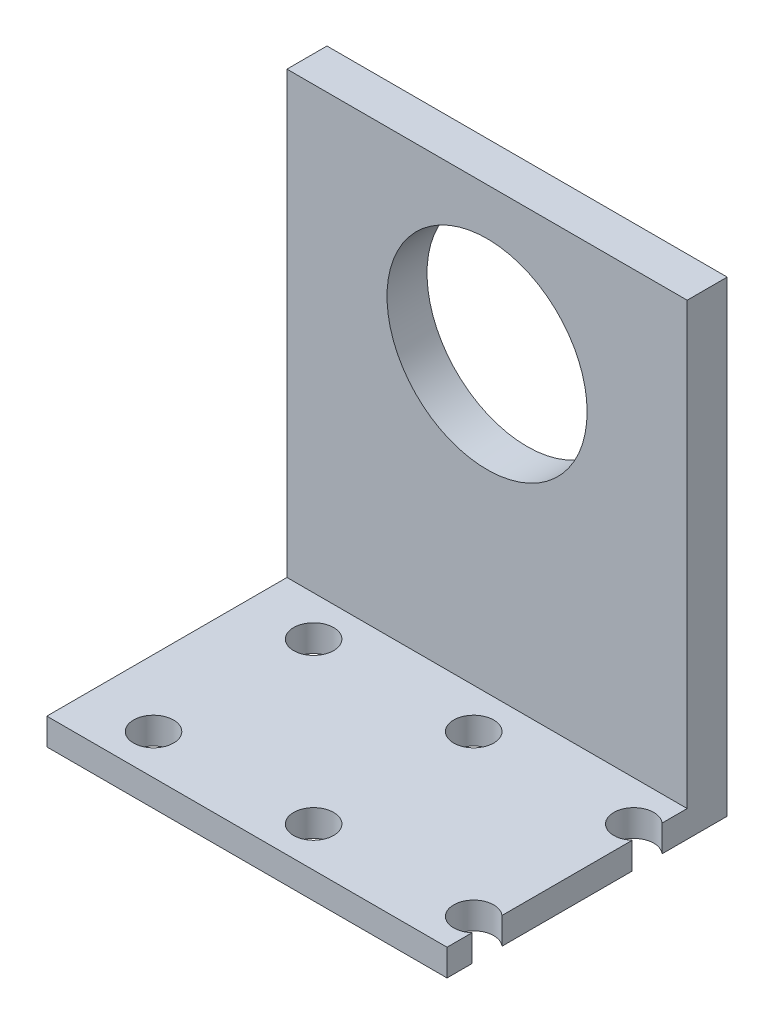
ISO-10303-21;
HEADER;
FILE_DESCRIPTION(('STEP AP214'),'2;1');
FILE_NAME('part.step','',(''),(''),'','','');
FILE_SCHEMA(('AUTOMOTIVE_DESIGN { 1 0 10303 214 1 1 1 1 }'));
ENDSEC;
DATA;
#1=APPLICATION_CONTEXT('core data for automotive mechanical design processes');
#2=APPLICATION_PROTOCOL_DEFINITION('international standard','automotive_design',2000,#1);
#3=PRODUCT_CONTEXT('',#1,'mechanical');
#4=PRODUCT('Part','Part','',(#3));
#5=PRODUCT_RELATED_PRODUCT_CATEGORY('part','',(#4));
#6=PRODUCT_DEFINITION_FORMATION('','',#4);
#7=PRODUCT_DEFINITION_CONTEXT('part definition',#1,'design');
#8=PRODUCT_DEFINITION('design','',#6,#7);
#9=PRODUCT_DEFINITION_SHAPE('','',#8);
#10=(LENGTH_UNIT() NAMED_UNIT(*) SI_UNIT(.MILLI.,.METRE.));
#11=(NAMED_UNIT(*) PLANE_ANGLE_UNIT() SI_UNIT($,.RADIAN.));
#12=(NAMED_UNIT(*) SI_UNIT($,.STERADIAN.) SOLID_ANGLE_UNIT());
#13=UNCERTAINTY_MEASURE_WITH_UNIT(LENGTH_MEASURE(1.E-05),#10,'distance_accuracy_value','');
#14=(GEOMETRIC_REPRESENTATION_CONTEXT(3) GLOBAL_UNCERTAINTY_ASSIGNED_CONTEXT((#13)) GLOBAL_UNIT_ASSIGNED_CONTEXT((#10,
#11,#12)) REPRESENTATION_CONTEXT('',''));
#15=CARTESIAN_POINT('',(0.,0.,0.));
#16=DIRECTION('',(0.,0.,1.));
#17=DIRECTION('',(1.,0.,0.));
#18=AXIS2_PLACEMENT_3D('',#15,#16,#17);
#19=CARTESIAN_POINT('',(30.,0.,0.));
#20=DIRECTION('',(-1.,0.,0.));
#21=DIRECTION('',(0.,0.,1.));
#22=AXIS2_PLACEMENT_3D('',#19,#20,#21);
#23=PLANE('',#22);
#24=DIRECTION('',(0.,0.,-1.));
#25=VECTOR('',#24,1.);
#26=CARTESIAN_POINT('',(30.,-2.,-21.));
#27=LINE('',#26,#25);
#28=CARTESIAN_POINT('',(30.,-2.,-4.1180339887499));
#29=VERTEX_POINT('',#28);
#30=CARTESIAN_POINT('',(30.,-2.,-13.8819660112501));
#31=VERTEX_POINT('',#30);
#32=EDGE_CURVE('E175',#29,#31,#27,.T.);
#33=ORIENTED_EDGE('',*,*,#32,.T.);
#34=DIRECTION('',(0.,1.,0.));
#35=VECTOR('',#34,1.);
#36=CARTESIAN_POINT('',(30.,-30.,-13.8819660112501));
#37=LINE('',#36,#35);
#38=CARTESIAN_POINT('',(30.,0.,-13.8819660112501));
#39=VERTEX_POINT('',#38);
#40=EDGE_CURVE('E11',#31,#39,#37,.T.);
#41=ORIENTED_EDGE('',*,*,#40,.T.);
#42=DIRECTION('',(0.,0.,1.));
#43=VECTOR('',#42,1.);
#44=CARTESIAN_POINT('',(30.,0.,0.));
#45=LINE('',#44,#43);
#46=CARTESIAN_POINT('',(30.,0.,-4.1180339887499));
#47=VERTEX_POINT('',#46);
#48=EDGE_CURVE('E132',#39,#47,#45,.T.);
#49=ORIENTED_EDGE('',*,*,#48,.T.);
#50=DIRECTION('',(0.,1.,0.));
#51=VECTOR('',#50,1.);
#52=CARTESIAN_POINT('',(30.,-30.,-4.1180339887499));
#53=LINE('',#52,#51);
#54=EDGE_CURVE('E112',#47,#29,#53,.F.);
#55=ORIENTED_EDGE('',*,*,#54,.T.);
#56=EDGE_LOOP('',(#33,#41,#49,#55));
#57=FACE_BOUND('',#56,.T.);
#58=ADVANCED_FACE('F33',(#57),#23,.F.);
#59=CARTESIAN_POINT('',(30.,-2.,0.));
#60=VERTEX_POINT('',#59);
#61=CARTESIAN_POINT('',(30.,-2.,-1.8819660112501));
#62=VERTEX_POINT('',#61);
#63=EDGE_CURVE('E126',#60,#62,#27,.T.);
#64=ORIENTED_EDGE('',*,*,#63,.T.);
#65=DIRECTION('',(0.,1.,0.));
#66=VECTOR('',#65,1.);
#67=CARTESIAN_POINT('',(30.,-30.,-1.8819660112501));
#68=LINE('',#67,#66);
#69=CARTESIAN_POINT('',(30.,0.,-1.8819660112501));
#70=VERTEX_POINT('',#69);
#71=EDGE_CURVE('E111',#62,#70,#68,.T.);
#72=ORIENTED_EDGE('',*,*,#71,.T.);
#73=CARTESIAN_POINT('',(30.,0.,0.));
#74=VERTEX_POINT('',#73);
#75=EDGE_CURVE('E124',#70,#74,#45,.T.);
#76=ORIENTED_EDGE('',*,*,#75,.T.);
#77=DIRECTION('',(0.,-1.,0.));
#78=VECTOR('',#77,1.);
#79=CARTESIAN_POINT('',(30.,-2.,0.));
#80=LINE('',#79,#78);
#81=EDGE_CURVE('E176',#74,#60,#80,.T.);
#82=ORIENTED_EDGE('',*,*,#81,.T.);
#83=EDGE_LOOP('',(#64,#72,#76,#82));
#84=FACE_BOUND('',#83,.T.);
#85=ADVANCED_FACE('F122',(#84),#23,.F.);
#86=CARTESIAN_POINT('',(30.,-2.,0.));
#87=DIRECTION('',(0.,0.,-1.));
#88=DIRECTION('',(-1.,0.,0.));
#89=AXIS2_PLACEMENT_3D('',#86,#87,#88);
#90=PLANE('',#89);
#91=DIRECTION('',(0.,-1.,0.));
#92=VECTOR('',#91,1.);
#93=CARTESIAN_POINT('',(0.,-2.,0.));
#94=LINE('',#93,#92);
#95=CARTESIAN_POINT('',(0.,0.,0.));
#96=VERTEX_POINT('',#95);
#97=CARTESIAN_POINT('',(0.,-2.,0.));
#98=VERTEX_POINT('',#97);
#99=EDGE_CURVE('E226',#96,#98,#94,.T.);
#100=ORIENTED_EDGE('',*,*,#99,.T.);
#101=DIRECTION('',(-1.,0.,0.));
#102=VECTOR('',#101,1.);
#103=CARTESIAN_POINT('',(30.,-2.,0.));
#104=LINE('',#103,#102);
#105=EDGE_CURVE('E162',#60,#98,#104,.T.);
#106=ORIENTED_EDGE('',*,*,#105,.F.);
#107=ORIENTED_EDGE('',*,*,#81,.F.);
#108=DIRECTION('',(-1.,0.,0.));
#109=VECTOR('',#108,1.);
#110=CARTESIAN_POINT('',(30.,0.,0.));
#111=LINE('',#110,#109);
#112=EDGE_CURVE('E130',#74,#96,#111,.T.);
#113=ORIENTED_EDGE('',*,*,#112,.T.);
#114=EDGE_LOOP('',(#100,#106,#107,#113));
#115=FACE_BOUND('',#114,.T.);
#116=ADVANCED_FACE('F35',(#115),#90,.F.);
#117=CARTESIAN_POINT('',(30.,-2.,-21.));
#118=DIRECTION('',(0.,1.,0.));
#119=DIRECTION('',(0.,0.,1.));
#120=AXIS2_PLACEMENT_3D('',#117,#118,#119);
#121=PLANE('',#120);
#122=CARTESIAN_POINT('',(5.,-2.,-15.));
#123=DIRECTION('',(0.,1.,0.));
#124=DIRECTION('',(0.,0.,1.));
#125=AXIS2_PLACEMENT_3D('',#122,#123,#124);
#126=CIRCLE('',#125,1.5);
#127=CARTESIAN_POINT('',(5.,-2.,-13.5));
#128=VERTEX_POINT('',#127);
#129=EDGE_CURVE('E218',#128,#128,#126,.T.);
#130=ORIENTED_EDGE('',*,*,#129,.T.);
#131=EDGE_LOOP('',(#130));
#132=FACE_BOUND('',#131,.T.);
#133=CARTESIAN_POINT('',(17.,-2.,-15.));
#134=DIRECTION('',(0.,1.,0.));
#135=DIRECTION('',(0.,0.,1.));
#136=AXIS2_PLACEMENT_3D('',#133,#134,#135);
#137=CIRCLE('',#136,1.5);
#138=CARTESIAN_POINT('',(17.,-2.,-13.5));
#139=VERTEX_POINT('',#138);
#140=EDGE_CURVE('E215',#139,#139,#137,.T.);
#141=ORIENTED_EDGE('',*,*,#140,.T.);
#142=EDGE_LOOP('',(#141));
#143=FACE_BOUND('',#142,.T.);
#144=CARTESIAN_POINT('',(17.,-2.,-3.));
#145=DIRECTION('',(0.,1.,0.));
#146=DIRECTION('',(0.,0.,1.));
#147=AXIS2_PLACEMENT_3D('',#144,#145,#146);
#148=CIRCLE('',#147,1.5);
#149=CARTESIAN_POINT('',(17.,-2.,-1.5));
#150=VERTEX_POINT('',#149);
#151=EDGE_CURVE('E212',#150,#150,#148,.T.);
#152=ORIENTED_EDGE('',*,*,#151,.T.);
#153=EDGE_LOOP('',(#152));
#154=FACE_BOUND('',#153,.T.);
#155=CARTESIAN_POINT('',(5.,-2.,-3.));
#156=DIRECTION('',(0.,1.,0.));
#157=DIRECTION('',(0.,0.,1.));
#158=AXIS2_PLACEMENT_3D('',#155,#156,#157);
#159=CIRCLE('',#158,1.5);
#160=CARTESIAN_POINT('',(5.,-2.,-1.5));
#161=VERTEX_POINT('',#160);
#162=EDGE_CURVE('E209',#161,#161,#159,.T.);
#163=ORIENTED_EDGE('',*,*,#162,.T.);
#164=EDGE_LOOP('',(#163));
#165=FACE_BOUND('',#164,.T.);
#166=CARTESIAN_POINT('',(30.,-2.,-16.1180339887499));
#167=VERTEX_POINT('',#166);
#168=CARTESIAN_POINT('',(30.,-2.,-21.));
#169=VERTEX_POINT('',#168);
#170=EDGE_CURVE('E167',#167,#169,#27,.T.);
#171=ORIENTED_EDGE('',*,*,#170,.F.);
#172=CARTESIAN_POINT('',(29.,-2.,-15.));
#173=DIRECTION('',(0.,1.,0.));
#174=DIRECTION('',(0.,0.,1.));
#175=AXIS2_PLACEMENT_3D('',#172,#173,#174);
#176=CIRCLE('',#175,1.5);
#177=EDGE_CURVE('E48',#167,#31,#176,.T.);
#178=ORIENTED_EDGE('',*,*,#177,.T.);
#179=ORIENTED_EDGE('',*,*,#32,.F.);
#180=CARTESIAN_POINT('',(29.,-2.,-3.));
#181=DIRECTION('',(0.,1.,0.));
#182=DIRECTION('',(0.,0.,1.));
#183=AXIS2_PLACEMENT_3D('',#180,#181,#182);
#184=CIRCLE('',#183,1.5);
#185=EDGE_CURVE('E56',#29,#62,#184,.T.);
#186=ORIENTED_EDGE('',*,*,#185,.T.);
#187=ORIENTED_EDGE('',*,*,#63,.F.);
#188=ORIENTED_EDGE('',*,*,#105,.T.);
#189=DIRECTION('',(0.,0.,-1.));
#190=VECTOR('',#189,1.);
#191=CARTESIAN_POINT('',(0.,-2.,-21.));
#192=LINE('',#191,#190);
#193=CARTESIAN_POINT('',(0.,-2.,-21.));
#194=VERTEX_POINT('',#193);
#195=EDGE_CURVE('E229',#98,#194,#192,.T.);
#196=ORIENTED_EDGE('',*,*,#195,.T.);
#197=DIRECTION('',(-1.,0.,0.));
#198=VECTOR('',#197,1.);
#199=CARTESIAN_POINT('',(30.,-2.,-21.));
#200=LINE('',#199,#198);
#201=EDGE_CURVE('E159',#169,#194,#200,.T.);
#202=ORIENTED_EDGE('',*,*,#201,.F.);
#203=EDGE_LOOP('',(#171,#178,#179,#186,#187,#188,#196,#202));
#204=FACE_BOUND('',#203,.T.);
#205=ADVANCED_FACE('F171',(#132,#143,#154,#165,#204),#121,.F.);
#206=CARTESIAN_POINT('',(30.,33.,-21.));
#207=DIRECTION('',(0.,0.,1.));
#208=DIRECTION('',(0.,-1.,0.));
#209=AXIS2_PLACEMENT_3D('',#206,#207,#208);
#210=PLANE('',#209);
#211=CARTESIAN_POINT('',(15.,22.,-21.));
#212=DIRECTION('',(0.,0.,1.));
#213=DIRECTION('',(0.,-1.,0.));
#214=AXIS2_PLACEMENT_3D('',#211,#212,#213);
#215=CIRCLE('',#214,7.5);
#216=CARTESIAN_POINT('',(15.,14.5,-21.));
#217=VERTEX_POINT('',#216);
#218=EDGE_CURVE('E224',#217,#217,#215,.T.);
#219=ORIENTED_EDGE('',*,*,#218,.T.);
#220=EDGE_LOOP('',(#219));
#221=FACE_BOUND('',#220,.T.);
#222=DIRECTION('',(0.,1.,0.));
#223=VECTOR('',#222,1.);
#224=CARTESIAN_POINT('',(0.,33.,-21.));
#225=LINE('',#224,#223);
#226=CARTESIAN_POINT('',(0.,33.,-21.));
#227=VERTEX_POINT('',#226);
#228=EDGE_CURVE('E231',#194,#227,#225,.T.);
#229=ORIENTED_EDGE('',*,*,#228,.T.);
#230=DIRECTION('',(-1.,0.,0.));
#231=VECTOR('',#230,1.);
#232=CARTESIAN_POINT('',(30.,33.,-21.));
#233=LINE('',#232,#231);
#234=CARTESIAN_POINT('',(30.,33.,-21.));
#235=VERTEX_POINT('',#234);
#236=EDGE_CURVE('E156',#235,#227,#233,.T.);
#237=ORIENTED_EDGE('',*,*,#236,.F.);
#238=DIRECTION('',(0.,1.,0.));
#239=VECTOR('',#238,1.);
#240=CARTESIAN_POINT('',(30.,33.,-21.));
#241=LINE('',#240,#239);
#242=EDGE_CURVE('E180',#169,#235,#241,.T.);
#243=ORIENTED_EDGE('',*,*,#242,.F.);
#244=ORIENTED_EDGE('',*,*,#201,.T.);
#245=EDGE_LOOP('',(#229,#237,#243,#244));
#246=FACE_BOUND('',#245,.T.);
#247=ADVANCED_FACE('F243',(#221,#246),#210,.F.);
#248=CARTESIAN_POINT('',(30.,33.,-18.));
#249=DIRECTION('',(0.,-1.,0.));
#250=DIRECTION('',(0.,0.,-1.));
#251=AXIS2_PLACEMENT_3D('',#248,#249,#250);
#252=PLANE('',#251);
#253=DIRECTION('',(0.,0.,1.));
#254=VECTOR('',#253,1.);
#255=CARTESIAN_POINT('',(0.,33.,-18.));
#256=LINE('',#255,#254);
#257=CARTESIAN_POINT('',(0.,33.,-18.));
#258=VERTEX_POINT('',#257);
#259=EDGE_CURVE('E190',#227,#258,#256,.T.);
#260=ORIENTED_EDGE('',*,*,#259,.T.);
#261=DIRECTION('',(-1.,0.,0.));
#262=VECTOR('',#261,1.);
#263=CARTESIAN_POINT('',(30.,33.,-18.));
#264=LINE('',#263,#262);
#265=CARTESIAN_POINT('',(30.,33.,-18.));
#266=VERTEX_POINT('',#265);
#267=EDGE_CURVE('E148',#266,#258,#264,.T.);
#268=ORIENTED_EDGE('',*,*,#267,.F.);
#269=DIRECTION('',(0.,0.,1.));
#270=VECTOR('',#269,1.);
#271=CARTESIAN_POINT('',(30.,33.,-18.));
#272=LINE('',#271,#270);
#273=EDGE_CURVE('E136',#235,#266,#272,.T.);
#274=ORIENTED_EDGE('',*,*,#273,.F.);
#275=ORIENTED_EDGE('',*,*,#236,.T.);
#276=EDGE_LOOP('',(#260,#268,#274,#275));
#277=FACE_BOUND('',#276,.T.);
#278=ADVANCED_FACE('F188',(#277),#252,.F.);
#279=CARTESIAN_POINT('',(30.,0.,-18.));
#280=DIRECTION('',(0.,0.,-1.));
#281=DIRECTION('',(-1.,0.,0.));
#282=AXIS2_PLACEMENT_3D('',#279,#280,#281);
#283=PLANE('',#282);
#284=CARTESIAN_POINT('',(15.,22.,-18.));
#285=DIRECTION('',(0.,0.,1.));
#286=DIRECTION('',(1.,0.,0.));
#287=AXIS2_PLACEMENT_3D('',#284,#285,#286);
#288=CIRCLE('',#287,7.5);
#289=CARTESIAN_POINT('',(22.5,22.,-18.));
#290=VERTEX_POINT('',#289);
#291=EDGE_CURVE('E221',#290,#290,#288,.T.);
#292=ORIENTED_EDGE('',*,*,#291,.F.);
#293=EDGE_LOOP('',(#292));
#294=FACE_BOUND('',#293,.T.);
#295=DIRECTION('',(0.,-1.,0.));
#296=VECTOR('',#295,1.);
#297=CARTESIAN_POINT('',(0.,0.,-18.));
#298=LINE('',#297,#296);
#299=CARTESIAN_POINT('',(0.,0.,-18.));
#300=VERTEX_POINT('',#299);
#301=EDGE_CURVE('E194',#258,#300,#298,.T.);
#302=ORIENTED_EDGE('',*,*,#301,.T.);
#303=DIRECTION('',(-1.,0.,0.));
#304=VECTOR('',#303,1.);
#305=CARTESIAN_POINT('',(30.,0.,-18.));
#306=LINE('',#305,#304);
#307=CARTESIAN_POINT('',(30.,0.,-18.));
#308=VERTEX_POINT('',#307);
#309=EDGE_CURVE('E142',#308,#300,#306,.T.);
#310=ORIENTED_EDGE('',*,*,#309,.F.);
#311=DIRECTION('',(0.,-1.,0.));
#312=VECTOR('',#311,1.);
#313=CARTESIAN_POINT('',(30.,0.,-18.));
#314=LINE('',#313,#312);
#315=EDGE_CURVE('E133',#266,#308,#314,.T.);
#316=ORIENTED_EDGE('',*,*,#315,.F.);
#317=ORIENTED_EDGE('',*,*,#267,.T.);
#318=EDGE_LOOP('',(#302,#310,#316,#317));
#319=FACE_BOUND('',#318,.T.);
#320=ADVANCED_FACE('F193',(#294,#319),#283,.F.);
#321=CARTESIAN_POINT('',(30.,0.,0.));
#322=DIRECTION('',(0.,-1.,0.));
#323=DIRECTION('',(0.,0.,-1.));
#324=AXIS2_PLACEMENT_3D('',#321,#322,#323);
#325=PLANE('',#324);
#326=CARTESIAN_POINT('',(5.,0.,-15.));
#327=DIRECTION('',(0.,1.,0.));
#328=DIRECTION('',(0.,0.,1.));
#329=AXIS2_PLACEMENT_3D('',#326,#327,#328);
#330=CIRCLE('',#329,1.5);
#331=CARTESIAN_POINT('',(5.,0.,-13.5));
#332=VERTEX_POINT('',#331);
#333=EDGE_CURVE('E197',#332,#332,#330,.T.);
#334=ORIENTED_EDGE('',*,*,#333,.F.);
#335=EDGE_LOOP('',(#334));
#336=FACE_BOUND('',#335,.T.);
#337=CARTESIAN_POINT('',(17.,0.,-15.));
#338=DIRECTION('',(0.,1.,0.));
#339=DIRECTION('',(0.,0.,1.));
#340=AXIS2_PLACEMENT_3D('',#337,#338,#339);
#341=CIRCLE('',#340,1.5);
#342=CARTESIAN_POINT('',(17.,0.,-13.5));
#343=VERTEX_POINT('',#342);
#344=EDGE_CURVE('E118',#343,#343,#341,.T.);
#345=ORIENTED_EDGE('',*,*,#344,.F.);
#346=EDGE_LOOP('',(#345));
#347=FACE_BOUND('',#346,.T.);
#348=CARTESIAN_POINT('',(17.,0.,-3.));
#349=DIRECTION('',(0.,1.,0.));
#350=DIRECTION('',(0.,0.,1.));
#351=AXIS2_PLACEMENT_3D('',#348,#349,#350);
#352=CIRCLE('',#351,1.5);
#353=CARTESIAN_POINT('',(17.,0.,-1.5));
#354=VERTEX_POINT('',#353);
#355=EDGE_CURVE('E117',#354,#354,#352,.T.);
#356=ORIENTED_EDGE('',*,*,#355,.F.);
#357=EDGE_LOOP('',(#356));
#358=FACE_BOUND('',#357,.T.);
#359=CARTESIAN_POINT('',(5.,0.,-3.));
#360=DIRECTION('',(0.,1.,0.));
#361=DIRECTION('',(0.,0.,1.));
#362=AXIS2_PLACEMENT_3D('',#359,#360,#361);
#363=CIRCLE('',#362,1.5);
#364=CARTESIAN_POINT('',(5.,0.,-1.5));
#365=VERTEX_POINT('',#364);
#366=EDGE_CURVE('E204',#365,#365,#363,.T.);
#367=ORIENTED_EDGE('',*,*,#366,.F.);
#368=EDGE_LOOP('',(#367));
#369=FACE_BOUND('',#368,.T.);
#370=ORIENTED_EDGE('',*,*,#48,.F.);
#371=CARTESIAN_POINT('',(29.,0.,-15.));
#372=DIRECTION('',(0.,1.,0.));
#373=DIRECTION('',(0.,0.,1.));
#374=AXIS2_PLACEMENT_3D('',#371,#372,#373);
#375=CIRCLE('',#374,1.5);
#376=CARTESIAN_POINT('',(30.,0.,-16.1180339887499));
#377=VERTEX_POINT('',#376);
#378=EDGE_CURVE('E196',#377,#39,#375,.T.);
#379=ORIENTED_EDGE('',*,*,#378,.F.);
#380=EDGE_CURVE('E135',#308,#377,#45,.T.);
#381=ORIENTED_EDGE('',*,*,#380,.F.);
#382=ORIENTED_EDGE('',*,*,#309,.T.);
#383=DIRECTION('',(0.,0.,1.));
#384=VECTOR('',#383,1.);
#385=CARTESIAN_POINT('',(0.,0.,0.));
#386=LINE('',#385,#384);
#387=EDGE_CURVE('E151',#300,#96,#386,.T.);
#388=ORIENTED_EDGE('',*,*,#387,.T.);
#389=ORIENTED_EDGE('',*,*,#112,.F.);
#390=ORIENTED_EDGE('',*,*,#75,.F.);
#391=CARTESIAN_POINT('',(29.,0.,-3.));
#392=DIRECTION('',(0.,1.,0.));
#393=DIRECTION('',(0.,0.,1.));
#394=AXIS2_PLACEMENT_3D('',#391,#392,#393);
#395=CIRCLE('',#394,1.5);
#396=EDGE_CURVE('E108',#47,#70,#395,.T.);
#397=ORIENTED_EDGE('',*,*,#396,.F.);
#398=EDGE_LOOP('',(#370,#379,#381,#382,#388,#389,#390,#397));
#399=FACE_BOUND('',#398,.T.);
#400=ADVANCED_FACE('F128',(#336,#347,#358,#369,#399),#325,.F.);
#401=ORIENTED_EDGE('',*,*,#380,.T.);
#402=DIRECTION('',(0.,1.,0.));
#403=VECTOR('',#402,1.);
#404=CARTESIAN_POINT('',(30.,-30.,-16.1180339887499));
#405=LINE('',#404,#403);
#406=EDGE_CURVE('E41',#377,#167,#405,.F.);
#407=ORIENTED_EDGE('',*,*,#406,.T.);
#408=ORIENTED_EDGE('',*,*,#170,.T.);
#409=ORIENTED_EDGE('',*,*,#242,.T.);
#410=ORIENTED_EDGE('',*,*,#273,.T.);
#411=ORIENTED_EDGE('',*,*,#315,.T.);
#412=EDGE_LOOP('',(#401,#407,#408,#409,#410,#411));
#413=FACE_BOUND('',#412,.T.);
#414=ADVANCED_FACE('F166',(#413),#23,.F.);
#415=CARTESIAN_POINT('',(0.,0.,0.));
#416=DIRECTION('',(-1.,0.,0.));
#417=DIRECTION('',(0.,0.,1.));
#418=AXIS2_PLACEMENT_3D('',#415,#416,#417);
#419=PLANE('',#418);
#420=ORIENTED_EDGE('',*,*,#99,.F.);
#421=ORIENTED_EDGE('',*,*,#387,.F.);
#422=ORIENTED_EDGE('',*,*,#301,.F.);
#423=ORIENTED_EDGE('',*,*,#259,.F.);
#424=ORIENTED_EDGE('',*,*,#228,.F.);
#425=ORIENTED_EDGE('',*,*,#195,.F.);
#426=EDGE_LOOP('',(#420,#421,#422,#423,#424,#425));
#427=FACE_BOUND('',#426,.T.);
#428=ADVANCED_FACE('F236',(#427),#419,.T.);
#429=CARTESIAN_POINT('',(15.,22.,-48.));
#430=DIRECTION('',(0.,0.,1.));
#431=DIRECTION('',(1.,0.,0.));
#432=AXIS2_PLACEMENT_3D('',#429,#430,#431);
#433=CYLINDRICAL_SURFACE('',#432,7.5);
#434=ORIENTED_EDGE('',*,*,#291,.T.);
#435=EDGE_LOOP('',(#434));
#436=FACE_BOUND('',#435,.T.);
#437=ORIENTED_EDGE('',*,*,#218,.F.);
#438=EDGE_LOOP('',(#437));
#439=FACE_BOUND('',#438,.T.);
#440=ADVANCED_FACE('F257',(#436,#439),#433,.F.);
#441=CARTESIAN_POINT('',(29.,-30.,-3.));
#442=DIRECTION('',(0.,1.,0.));
#443=DIRECTION('',(0.,0.,1.));
#444=AXIS2_PLACEMENT_3D('',#441,#442,#443);
#445=CYLINDRICAL_SURFACE('',#444,1.5);
#446=ORIENTED_EDGE('',*,*,#185,.F.);
#447=ORIENTED_EDGE('',*,*,#54,.F.);
#448=ORIENTED_EDGE('',*,*,#396,.T.);
#449=ORIENTED_EDGE('',*,*,#71,.F.);
#450=EDGE_LOOP('',(#446,#447,#448,#449));
#451=FACE_BOUND('',#450,.T.);
#452=ADVANCED_FACE('F110',(#451),#445,.F.);
#453=CARTESIAN_POINT('',(29.,-30.,-15.));
#454=DIRECTION('',(0.,1.,0.));
#455=DIRECTION('',(0.,0.,1.));
#456=AXIS2_PLACEMENT_3D('',#453,#454,#455);
#457=CYLINDRICAL_SURFACE('',#456,1.5);
#458=ORIENTED_EDGE('',*,*,#177,.F.);
#459=ORIENTED_EDGE('',*,*,#406,.F.);
#460=ORIENTED_EDGE('',*,*,#378,.T.);
#461=ORIENTED_EDGE('',*,*,#40,.F.);
#462=EDGE_LOOP('',(#458,#459,#460,#461));
#463=FACE_BOUND('',#462,.T.);
#464=ADVANCED_FACE('F326',(#463),#457,.F.);
#465=CARTESIAN_POINT('',(5.,-30.,-3.));
#466=DIRECTION('',(0.,1.,0.));
#467=DIRECTION('',(0.,0.,1.));
#468=AXIS2_PLACEMENT_3D('',#465,#466,#467);
#469=CYLINDRICAL_SURFACE('',#468,1.5);
#470=ORIENTED_EDGE('',*,*,#366,.T.);
#471=EDGE_LOOP('',(#470));
#472=FACE_BOUND('',#471,.T.);
#473=ORIENTED_EDGE('',*,*,#162,.F.);
#474=EDGE_LOOP('',(#473));
#475=FACE_BOUND('',#474,.T.);
#476=ADVANCED_FACE('F335',(#472,#475),#469,.F.);
#477=CARTESIAN_POINT('',(17.,-30.,-3.));
#478=DIRECTION('',(0.,1.,0.));
#479=DIRECTION('',(0.,0.,1.));
#480=AXIS2_PLACEMENT_3D('',#477,#478,#479);
#481=CYLINDRICAL_SURFACE('',#480,1.5);
#482=ORIENTED_EDGE('',*,*,#355,.T.);
#483=EDGE_LOOP('',(#482));
#484=FACE_BOUND('',#483,.T.);
#485=ORIENTED_EDGE('',*,*,#151,.F.);
#486=EDGE_LOOP('',(#485));
#487=FACE_BOUND('',#486,.T.);
#488=ADVANCED_FACE('F344',(#484,#487),#481,.F.);
#489=CARTESIAN_POINT('',(17.,-30.,-15.));
#490=DIRECTION('',(0.,1.,0.));
#491=DIRECTION('',(0.,0.,1.));
#492=AXIS2_PLACEMENT_3D('',#489,#490,#491);
#493=CYLINDRICAL_SURFACE('',#492,1.5);
#494=ORIENTED_EDGE('',*,*,#344,.T.);
#495=EDGE_LOOP('',(#494));
#496=FACE_BOUND('',#495,.T.);
#497=ORIENTED_EDGE('',*,*,#140,.F.);
#498=EDGE_LOOP('',(#497));
#499=FACE_BOUND('',#498,.T.);
#500=ADVANCED_FACE('F354',(#496,#499),#493,.F.);
#501=CARTESIAN_POINT('',(5.,-30.,-15.));
#502=DIRECTION('',(0.,1.,0.));
#503=DIRECTION('',(0.,0.,1.));
#504=AXIS2_PLACEMENT_3D('',#501,#502,#503);
#505=CYLINDRICAL_SURFACE('',#504,1.5);
#506=ORIENTED_EDGE('',*,*,#333,.T.);
#507=EDGE_LOOP('',(#506));
#508=FACE_BOUND('',#507,.T.);
#509=ORIENTED_EDGE('',*,*,#129,.F.);
#510=EDGE_LOOP('',(#509));
#511=FACE_BOUND('',#510,.T.);
#512=ADVANCED_FACE('F364',(#508,#511),#505,.F.);
#513=CLOSED_SHELL('',(#58,#85,#116,#205,#247,#278,#320,#400,#414,#428,#440,#452,#464,#476,#488,
#500,#512));
#514=MANIFOLD_SOLID_BREP('B2',#513);
#515=ADVANCED_BREP_SHAPE_REPRESENTATION('',(#18,#514),#14);
#516=SHAPE_DEFINITION_REPRESENTATION(#9,#515);
ENDSEC;
END-ISO-10303-21;
